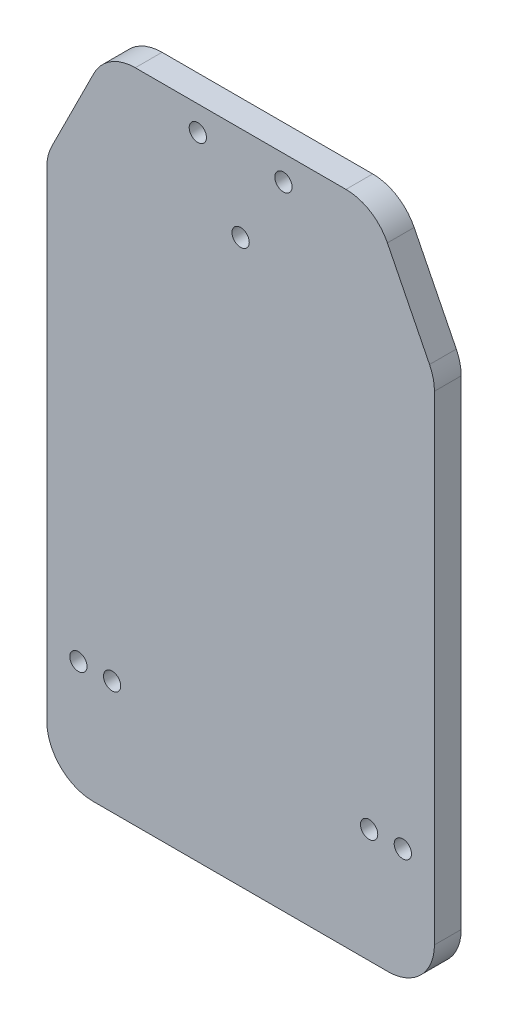
ISO-10303-21;
HEADER;
FILE_DESCRIPTION(('STEP AP214'),'2;1');
FILE_NAME('part.step','',(''),(''),'','','');
FILE_SCHEMA(('AUTOMOTIVE_DESIGN { 1 0 10303 214 1 1 1 1 }'));
ENDSEC;
DATA;
#1=APPLICATION_CONTEXT('core data for automotive mechanical design processes');
#2=APPLICATION_PROTOCOL_DEFINITION('international standard','automotive_design',2000,#1);
#3=PRODUCT_CONTEXT('',#1,'mechanical');
#4=PRODUCT('Part','Part','',(#3));
#5=PRODUCT_RELATED_PRODUCT_CATEGORY('part','',(#4));
#6=PRODUCT_DEFINITION_FORMATION('','',#4);
#7=PRODUCT_DEFINITION_CONTEXT('part definition',#1,'design');
#8=PRODUCT_DEFINITION('design','',#6,#7);
#9=PRODUCT_DEFINITION_SHAPE('','',#8);
#10=(LENGTH_UNIT() NAMED_UNIT(*) SI_UNIT(.MILLI.,.METRE.));
#11=(NAMED_UNIT(*) PLANE_ANGLE_UNIT() SI_UNIT($,.RADIAN.));
#12=(NAMED_UNIT(*) SI_UNIT($,.STERADIAN.) SOLID_ANGLE_UNIT());
#13=UNCERTAINTY_MEASURE_WITH_UNIT(LENGTH_MEASURE(1.E-05),#10,'distance_accuracy_value','');
#14=(GEOMETRIC_REPRESENTATION_CONTEXT(3) GLOBAL_UNCERTAINTY_ASSIGNED_CONTEXT((#13)) GLOBAL_UNIT_ASSIGNED_CONTEXT((#10,
#11,#12)) REPRESENTATION_CONTEXT('',''));
#15=CARTESIAN_POINT('',(0.,0.,0.));
#16=DIRECTION('',(0.,0.,1.));
#17=DIRECTION('',(1.,0.,0.));
#18=AXIS2_PLACEMENT_3D('',#15,#16,#17);
#19=CARTESIAN_POINT('',(55.,144.8,6.35));
#20=DIRECTION('',(0.,-1.,0.));
#21=DIRECTION('',(0.,0.,-1.));
#22=AXIS2_PLACEMENT_3D('',#19,#20,#21);
#23=PLANE('',#22);
#24=DIRECTION('',(-1.,0.,0.));
#25=VECTOR('',#24,1.);
#26=CARTESIAN_POINT('',(55.,144.8,0.));
#27=LINE('',#26,#25);
#28=CARTESIAN_POINT('',(80.,144.8,0.));
#29=VERTEX_POINT('',#28);
#30=CARTESIAN_POINT('',(30.,144.8,0.));
#31=VERTEX_POINT('',#30);
#32=EDGE_CURVE('E104',#29,#31,#27,.T.);
#33=ORIENTED_EDGE('',*,*,#32,.T.);
#34=DIRECTION('',(0.,0.,-1.));
#35=VECTOR('',#34,1.);
#36=CARTESIAN_POINT('',(30.,144.8,6.35));
#37=LINE('',#36,#35);
#38=CARTESIAN_POINT('',(30.,144.8,6.35));
#39=VERTEX_POINT('',#38);
#40=EDGE_CURVE('E11',#39,#31,#37,.T.);
#41=ORIENTED_EDGE('',*,*,#40,.F.);
#42=DIRECTION('',(1.,0.,0.));
#43=VECTOR('',#42,1.);
#44=CARTESIAN_POINT('',(55.,144.8,6.35));
#45=LINE('',#44,#43);
#46=CARTESIAN_POINT('',(80.,144.8,6.35));
#47=VERTEX_POINT('',#46);
#48=EDGE_CURVE('E58',#39,#47,#45,.T.);
#49=ORIENTED_EDGE('',*,*,#48,.T.);
#50=DIRECTION('',(0.,0.,-1.));
#51=VECTOR('',#50,1.);
#52=CARTESIAN_POINT('',(80.,144.8,6.35));
#53=LINE('',#52,#51);
#54=EDGE_CURVE('E43',#47,#29,#53,.T.);
#55=ORIENTED_EDGE('',*,*,#54,.T.);
#56=EDGE_LOOP('',(#33,#41,#49,#55));
#57=FACE_BOUND('',#56,.T.);
#58=ADVANCED_FACE('F39',(#57),#23,.F.);
#59=CARTESIAN_POINT('',(30.,133.8,6.35));
#60=DIRECTION('',(0.,0.,-1.));
#61=DIRECTION('',(-1.,0.,0.));
#62=AXIS2_PLACEMENT_3D('',#59,#60,#61);
#63=CYLINDRICAL_SURFACE('',#62,11.);
#64=CARTESIAN_POINT('',(30.,133.8,0.));
#65=DIRECTION('',(0.,0.,1.));
#66=DIRECTION('',(1.,0.,0.));
#67=AXIS2_PLACEMENT_3D('',#64,#65,#66);
#68=CIRCLE('',#67,11.);
#69=CARTESIAN_POINT('',(20.1613008990009,138.7193495505,0.));
#70=VERTEX_POINT('',#69);
#71=EDGE_CURVE('E98',#31,#70,#68,.T.);
#72=ORIENTED_EDGE('',*,*,#71,.T.);
#73=DIRECTION('',(0.,0.,-1.));
#74=VECTOR('',#73,1.);
#75=CARTESIAN_POINT('',(20.1613008990009,138.7193495505,6.35));
#76=LINE('',#75,#74);
#77=CARTESIAN_POINT('',(20.1613008990009,138.7193495505,6.35));
#78=VERTEX_POINT('',#77);
#79=EDGE_CURVE('E49',#78,#70,#76,.T.);
#80=ORIENTED_EDGE('',*,*,#79,.F.);
#81=CARTESIAN_POINT('',(30.,133.8,6.35));
#82=DIRECTION('',(0.,0.,1.));
#83=DIRECTION('',(1.,0.,0.));
#84=AXIS2_PLACEMENT_3D('',#81,#82,#83);
#85=CIRCLE('',#84,11.);
#86=EDGE_CURVE('E143',#39,#78,#85,.T.);
#87=ORIENTED_EDGE('',*,*,#86,.F.);
#88=ORIENTED_EDGE('',*,*,#40,.T.);
#89=EDGE_LOOP('',(#72,#80,#87,#88));
#90=FACE_BOUND('',#89,.T.);
#91=ADVANCED_FACE('F320',(#90),#63,.T.);
#92=CARTESIAN_POINT('',(20.1613008990009,138.7193495505,6.35));
#93=DIRECTION('',(0.894427190999917,-0.447213595499957,0.));
#94=DIRECTION('',(0.447213595499957,0.894427190999917,0.));
#95=AXIS2_PLACEMENT_3D('',#92,#93,#94);
#96=PLANE('',#95);
#97=DIRECTION('',(-0.447213595499957,-0.894427190999917,0.));
#98=VECTOR('',#97,1.);
#99=CARTESIAN_POINT('',(20.1613008990009,138.7193495505,0.));
#100=LINE('',#99,#98);
#101=CARTESIAN_POINT('',(10.161300899001,118.7193495505,0.));
#102=VERTEX_POINT('',#101);
#103=EDGE_CURVE('E150',#70,#102,#100,.T.);
#104=ORIENTED_EDGE('',*,*,#103,.T.);
#105=DIRECTION('',(0.,0.,-1.));
#106=VECTOR('',#105,1.);
#107=CARTESIAN_POINT('',(10.161300899001,118.7193495505,6.35));
#108=LINE('',#107,#106);
#109=CARTESIAN_POINT('',(10.161300899001,118.7193495505,6.35));
#110=VERTEX_POINT('',#109);
#111=EDGE_CURVE('E147',#110,#102,#108,.T.);
#112=ORIENTED_EDGE('',*,*,#111,.F.);
#113=DIRECTION('',(-0.447213595499957,-0.894427190999917,0.));
#114=VECTOR('',#113,1.);
#115=CARTESIAN_POINT('',(20.1613008990009,138.7193495505,6.35));
#116=LINE('',#115,#114);
#117=EDGE_CURVE('E136',#78,#110,#116,.T.);
#118=ORIENTED_EDGE('',*,*,#117,.F.);
#119=ORIENTED_EDGE('',*,*,#79,.T.);
#120=EDGE_LOOP('',(#104,#112,#118,#119));
#121=FACE_BOUND('',#120,.T.);
#122=ADVANCED_FACE('F148',(#121),#96,.F.);
#123=CARTESIAN_POINT('',(20.,113.8,6.35));
#124=DIRECTION('',(0.,0.,-1.));
#125=DIRECTION('',(-1.,0.,0.));
#126=AXIS2_PLACEMENT_3D('',#123,#124,#125);
#127=CYLINDRICAL_SURFACE('',#126,11.);
#128=CARTESIAN_POINT('',(20.,113.8,0.));
#129=DIRECTION('',(0.,0.,1.));
#130=DIRECTION('',(1.,0.,0.));
#131=AXIS2_PLACEMENT_3D('',#128,#129,#130);
#132=CIRCLE('',#131,11.);
#133=CARTESIAN_POINT('',(9.00000000000001,113.8,0.));
#134=VERTEX_POINT('',#133);
#135=EDGE_CURVE('E188',#102,#134,#132,.T.);
#136=ORIENTED_EDGE('',*,*,#135,.T.);
#137=DIRECTION('',(0.,0.,-1.));
#138=VECTOR('',#137,1.);
#139=CARTESIAN_POINT('',(9.00000000000001,113.8,6.35));
#140=LINE('',#139,#138);
#141=CARTESIAN_POINT('',(9.00000000000001,113.8,6.35));
#142=VERTEX_POINT('',#141);
#143=EDGE_CURVE('E153',#142,#134,#140,.T.);
#144=ORIENTED_EDGE('',*,*,#143,.F.);
#145=CARTESIAN_POINT('',(20.,113.8,6.35));
#146=DIRECTION('',(0.,0.,1.));
#147=DIRECTION('',(1.,0.,0.));
#148=AXIS2_PLACEMENT_3D('',#145,#146,#147);
#149=CIRCLE('',#148,11.);
#150=EDGE_CURVE('E140',#110,#142,#149,.T.);
#151=ORIENTED_EDGE('',*,*,#150,.F.);
#152=ORIENTED_EDGE('',*,*,#111,.T.);
#153=EDGE_LOOP('',(#136,#144,#151,#152));
#154=FACE_BOUND('',#153,.T.);
#155=ADVANCED_FACE('F155',(#154),#127,.T.);
#156=CARTESIAN_POINT('',(9.,113.8,6.35));
#157=DIRECTION('',(1.,0.,0.));
#158=DIRECTION('',(0.,0.,-1.));
#159=AXIS2_PLACEMENT_3D('',#156,#157,#158);
#160=PLANE('',#159);
#161=DIRECTION('',(0.,-1.,0.));
#162=VECTOR('',#161,1.);
#163=CARTESIAN_POINT('',(9.,113.8,0.));
#164=LINE('',#163,#162);
#165=CARTESIAN_POINT('',(9.,0.,0.));
#166=VERTEX_POINT('',#165);
#167=EDGE_CURVE('E186',#134,#166,#164,.T.);
#168=ORIENTED_EDGE('',*,*,#167,.T.);
#169=DIRECTION('',(0.,0.,-1.));
#170=VECTOR('',#169,1.);
#171=CARTESIAN_POINT('',(9.,0.,6.35));
#172=LINE('',#171,#170);
#173=CARTESIAN_POINT('',(9.,0.,6.35));
#174=VERTEX_POINT('',#173);
#175=EDGE_CURVE('E195',#174,#166,#172,.T.);
#176=ORIENTED_EDGE('',*,*,#175,.F.);
#177=DIRECTION('',(0.,-1.,0.));
#178=VECTOR('',#177,1.);
#179=CARTESIAN_POINT('',(9.,113.8,6.35));
#180=LINE('',#179,#178);
#181=EDGE_CURVE('E158',#142,#174,#180,.T.);
#182=ORIENTED_EDGE('',*,*,#181,.F.);
#183=ORIENTED_EDGE('',*,*,#143,.T.);
#184=EDGE_LOOP('',(#168,#176,#182,#183));
#185=FACE_BOUND('',#184,.T.);
#186=ADVANCED_FACE('F215',(#185),#160,.F.);
#187=CARTESIAN_POINT('',(20.,0.,6.35));
#188=DIRECTION('',(0.,0.,-1.));
#189=DIRECTION('',(-1.,0.,0.));
#190=AXIS2_PLACEMENT_3D('',#187,#188,#189);
#191=CYLINDRICAL_SURFACE('',#190,11.);
#192=CARTESIAN_POINT('',(20.,0.,0.));
#193=DIRECTION('',(0.,0.,1.));
#194=DIRECTION('',(1.,0.,0.));
#195=AXIS2_PLACEMENT_3D('',#192,#193,#194);
#196=CIRCLE('',#195,11.);
#197=CARTESIAN_POINT('',(20.,-11.,0.));
#198=VERTEX_POINT('',#197);
#199=EDGE_CURVE('E184',#166,#198,#196,.T.);
#200=ORIENTED_EDGE('',*,*,#199,.T.);
#201=DIRECTION('',(0.,0.,-1.));
#202=VECTOR('',#201,1.);
#203=CARTESIAN_POINT('',(20.,-11.,6.35));
#204=LINE('',#203,#202);
#205=CARTESIAN_POINT('',(20.,-11.,6.35));
#206=VERTEX_POINT('',#205);
#207=EDGE_CURVE('E198',#206,#198,#204,.T.);
#208=ORIENTED_EDGE('',*,*,#207,.F.);
#209=CARTESIAN_POINT('',(20.,0.,6.35));
#210=DIRECTION('',(0.,0.,1.));
#211=DIRECTION('',(1.,0.,0.));
#212=AXIS2_PLACEMENT_3D('',#209,#210,#211);
#213=CIRCLE('',#212,11.);
#214=EDGE_CURVE('E160',#174,#206,#213,.T.);
#215=ORIENTED_EDGE('',*,*,#214,.F.);
#216=ORIENTED_EDGE('',*,*,#175,.T.);
#217=EDGE_LOOP('',(#200,#208,#215,#216));
#218=FACE_BOUND('',#217,.T.);
#219=ADVANCED_FACE('F224',(#218),#191,.T.);
#220=CARTESIAN_POINT('',(20.,-11.,6.35));
#221=DIRECTION('',(0.,1.,0.));
#222=DIRECTION('',(0.,0.,1.));
#223=AXIS2_PLACEMENT_3D('',#220,#221,#222);
#224=PLANE('',#223);
#225=DIRECTION('',(1.,0.,0.));
#226=VECTOR('',#225,1.);
#227=CARTESIAN_POINT('',(20.,-11.,0.));
#228=LINE('',#227,#226);
#229=CARTESIAN_POINT('',(90.,-11.,0.));
#230=VERTEX_POINT('',#229);
#231=EDGE_CURVE('E181',#198,#230,#228,.T.);
#232=ORIENTED_EDGE('',*,*,#231,.T.);
#233=DIRECTION('',(0.,0.,-1.));
#234=VECTOR('',#233,1.);
#235=CARTESIAN_POINT('',(90.,-11.,6.35));
#236=LINE('',#235,#234);
#237=CARTESIAN_POINT('',(90.,-11.,6.35));
#238=VERTEX_POINT('',#237);
#239=EDGE_CURVE('E201',#238,#230,#236,.T.);
#240=ORIENTED_EDGE('',*,*,#239,.F.);
#241=DIRECTION('',(1.,0.,0.));
#242=VECTOR('',#241,1.);
#243=CARTESIAN_POINT('',(20.,-11.,6.35));
#244=LINE('',#243,#242);
#245=EDGE_CURVE('E221',#206,#238,#244,.T.);
#246=ORIENTED_EDGE('',*,*,#245,.F.);
#247=ORIENTED_EDGE('',*,*,#207,.T.);
#248=EDGE_LOOP('',(#232,#240,#246,#247));
#249=FACE_BOUND('',#248,.T.);
#250=ADVANCED_FACE('F227',(#249),#224,.F.);
#251=CARTESIAN_POINT('',(90.,0.,6.35));
#252=DIRECTION('',(0.,0.,-1.));
#253=DIRECTION('',(-1.,0.,0.));
#254=AXIS2_PLACEMENT_3D('',#251,#252,#253);
#255=CYLINDRICAL_SURFACE('',#254,11.);
#256=CARTESIAN_POINT('',(90.,0.,0.));
#257=DIRECTION('',(0.,0.,-1.));
#258=DIRECTION('',(-1.,0.,0.));
#259=AXIS2_PLACEMENT_3D('',#256,#257,#258);
#260=CIRCLE('',#259,11.);
#261=CARTESIAN_POINT('',(101.,0.,0.));
#262=VERTEX_POINT('',#261);
#263=EDGE_CURVE('E178',#262,#230,#260,.T.);
#264=ORIENTED_EDGE('',*,*,#263,.F.);
#265=DIRECTION('',(0.,0.,-1.));
#266=VECTOR('',#265,1.);
#267=CARTESIAN_POINT('',(101.,0.,6.35));
#268=LINE('',#267,#266);
#269=CARTESIAN_POINT('',(101.,0.,6.35));
#270=VERTEX_POINT('',#269);
#271=EDGE_CURVE('E203',#270,#262,#268,.T.);
#272=ORIENTED_EDGE('',*,*,#271,.F.);
#273=CARTESIAN_POINT('',(90.,0.,6.35));
#274=DIRECTION('',(0.,0.,-1.));
#275=DIRECTION('',(-1.,0.,0.));
#276=AXIS2_PLACEMENT_3D('',#273,#274,#275);
#277=CIRCLE('',#276,11.);
#278=EDGE_CURVE('E229',#270,#238,#277,.T.);
#279=ORIENTED_EDGE('',*,*,#278,.T.);
#280=ORIENTED_EDGE('',*,*,#239,.T.);
#281=EDGE_LOOP('',(#264,#272,#279,#280));
#282=FACE_BOUND('',#281,.T.);
#283=ADVANCED_FACE('F336',(#282),#255,.T.);
#284=CARTESIAN_POINT('',(101.,113.8,6.35));
#285=DIRECTION('',(1.,0.,0.));
#286=DIRECTION('',(0.,0.,-1.));
#287=AXIS2_PLACEMENT_3D('',#284,#285,#286);
#288=PLANE('',#287);
#289=DIRECTION('',(0.,-1.,0.));
#290=VECTOR('',#289,1.);
#291=CARTESIAN_POINT('',(101.,113.8,0.));
#292=LINE('',#291,#290);
#293=CARTESIAN_POINT('',(101.,113.8,0.));
#294=VERTEX_POINT('',#293);
#295=EDGE_CURVE('E175',#294,#262,#292,.T.);
#296=ORIENTED_EDGE('',*,*,#295,.F.);
#297=DIRECTION('',(0.,0.,-1.));
#298=VECTOR('',#297,1.);
#299=CARTESIAN_POINT('',(101.,113.8,6.35));
#300=LINE('',#299,#298);
#301=CARTESIAN_POINT('',(101.,113.8,6.35));
#302=VERTEX_POINT('',#301);
#303=EDGE_CURVE('E205',#302,#294,#300,.T.);
#304=ORIENTED_EDGE('',*,*,#303,.F.);
#305=DIRECTION('',(0.,-1.,0.));
#306=VECTOR('',#305,1.);
#307=CARTESIAN_POINT('',(101.,113.8,6.35));
#308=LINE('',#307,#306);
#309=EDGE_CURVE('E231',#302,#270,#308,.T.);
#310=ORIENTED_EDGE('',*,*,#309,.T.);
#311=ORIENTED_EDGE('',*,*,#271,.T.);
#312=EDGE_LOOP('',(#296,#304,#310,#311));
#313=FACE_BOUND('',#312,.T.);
#314=ADVANCED_FACE('F339',(#313),#288,.T.);
#315=CARTESIAN_POINT('',(90.,113.8,6.35));
#316=DIRECTION('',(0.,0.,-1.));
#317=DIRECTION('',(-1.,0.,0.));
#318=AXIS2_PLACEMENT_3D('',#315,#316,#317);
#319=CYLINDRICAL_SURFACE('',#318,11.);
#320=CARTESIAN_POINT('',(90.,113.8,0.));
#321=DIRECTION('',(0.,0.,-1.));
#322=DIRECTION('',(-1.,0.,0.));
#323=AXIS2_PLACEMENT_3D('',#320,#321,#322);
#324=CIRCLE('',#323,11.);
#325=CARTESIAN_POINT('',(99.8386991009991,118.7193495505,0.));
#326=VERTEX_POINT('',#325);
#327=EDGE_CURVE('E172',#326,#294,#324,.T.);
#328=ORIENTED_EDGE('',*,*,#327,.F.);
#329=DIRECTION('',(0.,0.,-1.));
#330=VECTOR('',#329,1.);
#331=CARTESIAN_POINT('',(99.8386991009991,118.7193495505,6.35));
#332=LINE('',#331,#330);
#333=CARTESIAN_POINT('',(99.8386991009991,118.7193495505,6.35));
#334=VERTEX_POINT('',#333);
#335=EDGE_CURVE('E207',#334,#326,#332,.T.);
#336=ORIENTED_EDGE('',*,*,#335,.F.);
#337=CARTESIAN_POINT('',(90.,113.8,6.35));
#338=DIRECTION('',(0.,0.,-1.));
#339=DIRECTION('',(-1.,0.,0.));
#340=AXIS2_PLACEMENT_3D('',#337,#338,#339);
#341=CIRCLE('',#340,11.);
#342=EDGE_CURVE('E236',#334,#302,#341,.T.);
#343=ORIENTED_EDGE('',*,*,#342,.T.);
#344=ORIENTED_EDGE('',*,*,#303,.T.);
#345=EDGE_LOOP('',(#328,#336,#343,#344));
#346=FACE_BOUND('',#345,.T.);
#347=ADVANCED_FACE('F343',(#346),#319,.T.);
#348=CARTESIAN_POINT('',(89.8386991009991,138.7193495505,6.35));
#349=DIRECTION('',(0.894427190999915,0.447213595499959,0.));
#350=DIRECTION('',(-0.447213595499959,0.894427190999916,0.));
#351=AXIS2_PLACEMENT_3D('',#348,#349,#350);
#352=PLANE('',#351);
#353=DIRECTION('',(0.447213595499959,-0.894427190999916,0.));
#354=VECTOR('',#353,1.);
#355=CARTESIAN_POINT('',(89.8386991009991,138.7193495505,0.));
#356=LINE('',#355,#354);
#357=CARTESIAN_POINT('',(89.8386991009991,138.7193495505,0.));
#358=VERTEX_POINT('',#357);
#359=EDGE_CURVE('E168',#358,#326,#356,.T.);
#360=ORIENTED_EDGE('',*,*,#359,.F.);
#361=DIRECTION('',(0.,0.,-1.));
#362=VECTOR('',#361,1.);
#363=CARTESIAN_POINT('',(89.8386991009991,138.7193495505,6.35));
#364=LINE('',#363,#362);
#365=CARTESIAN_POINT('',(89.8386991009991,138.7193495505,6.35));
#366=VERTEX_POINT('',#365);
#367=EDGE_CURVE('E208',#366,#358,#364,.T.);
#368=ORIENTED_EDGE('',*,*,#367,.F.);
#369=DIRECTION('',(0.447213595499959,-0.894427190999916,0.));
#370=VECTOR('',#369,1.);
#371=CARTESIAN_POINT('',(89.8386991009991,138.7193495505,6.35));
#372=LINE('',#371,#370);
#373=EDGE_CURVE('E239',#366,#334,#372,.T.);
#374=ORIENTED_EDGE('',*,*,#373,.T.);
#375=ORIENTED_EDGE('',*,*,#335,.T.);
#376=EDGE_LOOP('',(#360,#368,#374,#375));
#377=FACE_BOUND('',#376,.T.);
#378=ADVANCED_FACE('F346',(#377),#352,.T.);
#379=CARTESIAN_POINT('',(80.,133.8,6.35));
#380=DIRECTION('',(0.,0.,-1.));
#381=DIRECTION('',(-1.,0.,0.));
#382=AXIS2_PLACEMENT_3D('',#379,#380,#381);
#383=CYLINDRICAL_SURFACE('',#382,11.);
#384=CARTESIAN_POINT('',(80.,133.8,0.));
#385=DIRECTION('',(0.,0.,-1.));
#386=DIRECTION('',(-1.,0.,0.));
#387=AXIS2_PLACEMENT_3D('',#384,#385,#386);
#388=CIRCLE('',#387,11.);
#389=EDGE_CURVE('E165',#29,#358,#388,.T.);
#390=ORIENTED_EDGE('',*,*,#389,.F.);
#391=ORIENTED_EDGE('',*,*,#54,.F.);
#392=CARTESIAN_POINT('',(80.,133.8,6.35));
#393=DIRECTION('',(0.,0.,-1.));
#394=DIRECTION('',(-1.,0.,0.));
#395=AXIS2_PLACEMENT_3D('',#392,#393,#394);
#396=CIRCLE('',#395,11.);
#397=EDGE_CURVE('E242',#47,#366,#396,.T.);
#398=ORIENTED_EDGE('',*,*,#397,.T.);
#399=ORIENTED_EDGE('',*,*,#367,.T.);
#400=EDGE_LOOP('',(#390,#391,#398,#399));
#401=FACE_BOUND('',#400,.T.);
#402=ADVANCED_FACE('F41',(#401),#383,.T.);
#403=CARTESIAN_POINT('',(80.,133.8,6.35));
#404=DIRECTION('',(0.,0.,-1.));
#405=DIRECTION('',(-1.,0.,0.));
#406=AXIS2_PLACEMENT_3D('',#403,#404,#405);
#407=PLANE('',#406);
#408=CARTESIAN_POINT('',(16.5,16.,6.35));
#409=DIRECTION('',(0.,0.,1.));
#410=DIRECTION('',(1.,0.,0.));
#411=AXIS2_PLACEMENT_3D('',#408,#409,#410);
#412=CIRCLE('',#411,2.05);
#413=CARTESIAN_POINT('',(18.55,16.,6.35));
#414=VERTEX_POINT('',#413);
#415=EDGE_CURVE('E256',#414,#414,#412,.T.);
#416=ORIENTED_EDGE('',*,*,#415,.F.);
#417=EDGE_LOOP('',(#416));
#418=FACE_BOUND('',#417,.T.);
#419=CARTESIAN_POINT('',(65.16,138.898469816456,6.35));
#420=DIRECTION('',(0.,0.,1.));
#421=DIRECTION('',(1.,0.,0.));
#422=AXIS2_PLACEMENT_3D('',#419,#420,#421);
#423=CIRCLE('',#422,2.04999999999999);
#424=CARTESIAN_POINT('',(67.21,138.898469816456,6.35));
#425=VERTEX_POINT('',#424);
#426=EDGE_CURVE('E271',#425,#425,#423,.T.);
#427=ORIENTED_EDGE('',*,*,#426,.F.);
#428=EDGE_LOOP('',(#427));
#429=FACE_BOUND('',#428,.T.);
#430=CARTESIAN_POINT('',(55.,122.428157316456,6.35));
#431=DIRECTION('',(0.,0.,1.));
#432=DIRECTION('',(1.,0.,0.));
#433=AXIS2_PLACEMENT_3D('',#430,#431,#432);
#434=CIRCLE('',#433,2.04999999999999);
#435=CARTESIAN_POINT('',(57.05,122.428157316456,6.35));
#436=VERTEX_POINT('',#435);
#437=EDGE_CURVE('E266',#436,#436,#434,.T.);
#438=ORIENTED_EDGE('',*,*,#437,.F.);
#439=EDGE_LOOP('',(#438));
#440=FACE_BOUND('',#439,.T.);
#441=CARTESIAN_POINT('',(24.5,16.,6.35));
#442=DIRECTION('',(0.,0.,1.));
#443=DIRECTION('',(1.,0.,0.));
#444=AXIS2_PLACEMENT_3D('',#441,#442,#443);
#445=CIRCLE('',#444,2.05);
#446=CARTESIAN_POINT('',(26.55,16.,6.35));
#447=VERTEX_POINT('',#446);
#448=EDGE_CURVE('E253',#447,#447,#445,.T.);
#449=ORIENTED_EDGE('',*,*,#448,.F.);
#450=EDGE_LOOP('',(#449));
#451=FACE_BOUND('',#450,.T.);
#452=CARTESIAN_POINT('',(85.5,16.,6.35));
#453=DIRECTION('',(0.,0.,1.));
#454=DIRECTION('',(1.,0.,0.));
#455=AXIS2_PLACEMENT_3D('',#452,#453,#454);
#456=CIRCLE('',#455,2.04999999999999);
#457=CARTESIAN_POINT('',(87.55,16.,6.35));
#458=VERTEX_POINT('',#457);
#459=EDGE_CURVE('E245',#458,#458,#456,.T.);
#460=ORIENTED_EDGE('',*,*,#459,.F.);
#461=EDGE_LOOP('',(#460));
#462=FACE_BOUND('',#461,.T.);
#463=CARTESIAN_POINT('',(93.5,16.,6.35));
#464=DIRECTION('',(0.,0.,1.));
#465=DIRECTION('',(1.,0.,0.));
#466=AXIS2_PLACEMENT_3D('',#463,#464,#465);
#467=CIRCLE('',#466,2.04999999999999);
#468=CARTESIAN_POINT('',(95.55,16.,6.35));
#469=VERTEX_POINT('',#468);
#470=EDGE_CURVE('E252',#469,#469,#467,.T.);
#471=ORIENTED_EDGE('',*,*,#470,.F.);
#472=EDGE_LOOP('',(#471));
#473=FACE_BOUND('',#472,.T.);
#474=CARTESIAN_POINT('',(44.84,138.898469816456,6.35));
#475=DIRECTION('',(0.,0.,1.));
#476=DIRECTION('',(1.,0.,0.));
#477=AXIS2_PLACEMENT_3D('',#474,#475,#476);
#478=CIRCLE('',#477,2.04999999999999);
#479=CARTESIAN_POINT('',(46.89,138.898469816456,6.35));
#480=VERTEX_POINT('',#479);
#481=EDGE_CURVE('E259',#480,#480,#478,.T.);
#482=ORIENTED_EDGE('',*,*,#481,.F.);
#483=EDGE_LOOP('',(#482));
#484=FACE_BOUND('',#483,.T.);
#485=ORIENTED_EDGE('',*,*,#48,.F.);
#486=ORIENTED_EDGE('',*,*,#86,.T.);
#487=ORIENTED_EDGE('',*,*,#117,.T.);
#488=ORIENTED_EDGE('',*,*,#150,.T.);
#489=ORIENTED_EDGE('',*,*,#181,.T.);
#490=ORIENTED_EDGE('',*,*,#214,.T.);
#491=ORIENTED_EDGE('',*,*,#245,.T.);
#492=ORIENTED_EDGE('',*,*,#278,.F.);
#493=ORIENTED_EDGE('',*,*,#309,.F.);
#494=ORIENTED_EDGE('',*,*,#342,.F.);
#495=ORIENTED_EDGE('',*,*,#373,.F.);
#496=ORIENTED_EDGE('',*,*,#397,.F.);
#497=EDGE_LOOP('',(#485,#486,#487,#488,#489,#490,#491,#492,#493,#494,#495,#496));
#498=FACE_BOUND('',#497,.T.);
#499=ADVANCED_FACE('F138',(#418,#429,#440,#451,#462,#473,#484,#498),#407,.F.);
#500=CARTESIAN_POINT('',(80.,133.8,0.));
#501=DIRECTION('',(0.,0.,-1.));
#502=DIRECTION('',(-1.,0.,0.));
#503=AXIS2_PLACEMENT_3D('',#500,#501,#502);
#504=PLANE('',#503);
#505=CARTESIAN_POINT('',(16.5,16.,0.));
#506=DIRECTION('',(0.,0.,-1.));
#507=DIRECTION('',(-1.,0.,0.));
#508=AXIS2_PLACEMENT_3D('',#505,#506,#507);
#509=CIRCLE('',#508,2.05);
#510=CARTESIAN_POINT('',(14.45,16.,0.));
#511=VERTEX_POINT('',#510);
#512=EDGE_CURVE('E169',#511,#511,#509,.F.);
#513=ORIENTED_EDGE('',*,*,#512,.T.);
#514=EDGE_LOOP('',(#513));
#515=FACE_BOUND('',#514,.T.);
#516=CARTESIAN_POINT('',(65.16,138.898469816456,0.));
#517=DIRECTION('',(0.,0.,-1.));
#518=DIRECTION('',(-1.,0.,0.));
#519=AXIS2_PLACEMENT_3D('',#516,#517,#518);
#520=CIRCLE('',#519,2.04999999999999);
#521=CARTESIAN_POINT('',(63.11,138.898469816456,0.));
#522=VERTEX_POINT('',#521);
#523=EDGE_CURVE('E275',#522,#522,#520,.F.);
#524=ORIENTED_EDGE('',*,*,#523,.T.);
#525=EDGE_LOOP('',(#524));
#526=FACE_BOUND('',#525,.T.);
#527=CARTESIAN_POINT('',(55.,122.428157316456,0.));
#528=DIRECTION('',(0.,0.,-1.));
#529=DIRECTION('',(-1.,0.,0.));
#530=AXIS2_PLACEMENT_3D('',#527,#528,#529);
#531=CIRCLE('',#530,2.04999999999999);
#532=CARTESIAN_POINT('',(52.95,122.428157316456,0.));
#533=VERTEX_POINT('',#532);
#534=EDGE_CURVE('E274',#533,#533,#531,.F.);
#535=ORIENTED_EDGE('',*,*,#534,.T.);
#536=EDGE_LOOP('',(#535));
#537=FACE_BOUND('',#536,.T.);
#538=CARTESIAN_POINT('',(24.5,16.,0.));
#539=DIRECTION('',(0.,0.,-1.));
#540=DIRECTION('',(-1.,0.,0.));
#541=AXIS2_PLACEMENT_3D('',#538,#539,#540);
#542=CIRCLE('',#541,2.05);
#543=CARTESIAN_POINT('',(22.45,16.,0.));
#544=VERTEX_POINT('',#543);
#545=EDGE_CURVE('E248',#544,#544,#542,.F.);
#546=ORIENTED_EDGE('',*,*,#545,.T.);
#547=EDGE_LOOP('',(#546));
#548=FACE_BOUND('',#547,.T.);
#549=CARTESIAN_POINT('',(85.5,16.,0.));
#550=DIRECTION('',(0.,0.,-1.));
#551=DIRECTION('',(-1.,0.,0.));
#552=AXIS2_PLACEMENT_3D('',#549,#550,#551);
#553=CIRCLE('',#552,2.04999999999999);
#554=CARTESIAN_POINT('',(83.45,16.,0.));
#555=VERTEX_POINT('',#554);
#556=EDGE_CURVE('E249',#555,#555,#553,.F.);
#557=ORIENTED_EDGE('',*,*,#556,.T.);
#558=EDGE_LOOP('',(#557));
#559=FACE_BOUND('',#558,.T.);
#560=CARTESIAN_POINT('',(93.5,16.,0.));
#561=DIRECTION('',(0.,0.,-1.));
#562=DIRECTION('',(-1.,0.,0.));
#563=AXIS2_PLACEMENT_3D('',#560,#561,#562);
#564=CIRCLE('',#563,2.04999999999999);
#565=CARTESIAN_POINT('',(91.45,16.,0.));
#566=VERTEX_POINT('',#565);
#567=EDGE_CURVE('E262',#566,#566,#564,.F.);
#568=ORIENTED_EDGE('',*,*,#567,.T.);
#569=EDGE_LOOP('',(#568));
#570=FACE_BOUND('',#569,.T.);
#571=CARTESIAN_POINT('',(44.84,138.898469816456,0.));
#572=DIRECTION('',(0.,0.,-1.));
#573=DIRECTION('',(-1.,0.,0.));
#574=AXIS2_PLACEMENT_3D('',#571,#572,#573);
#575=CIRCLE('',#574,2.04999999999999);
#576=CARTESIAN_POINT('',(42.79,138.898469816456,0.));
#577=VERTEX_POINT('',#576);
#578=EDGE_CURVE('E263',#577,#577,#575,.F.);
#579=ORIENTED_EDGE('',*,*,#578,.T.);
#580=EDGE_LOOP('',(#579));
#581=FACE_BOUND('',#580,.T.);
#582=ORIENTED_EDGE('',*,*,#32,.F.);
#583=ORIENTED_EDGE('',*,*,#389,.T.);
#584=ORIENTED_EDGE('',*,*,#359,.T.);
#585=ORIENTED_EDGE('',*,*,#327,.T.);
#586=ORIENTED_EDGE('',*,*,#295,.T.);
#587=ORIENTED_EDGE('',*,*,#263,.T.);
#588=ORIENTED_EDGE('',*,*,#231,.F.);
#589=ORIENTED_EDGE('',*,*,#199,.F.);
#590=ORIENTED_EDGE('',*,*,#167,.F.);
#591=ORIENTED_EDGE('',*,*,#135,.F.);
#592=ORIENTED_EDGE('',*,*,#103,.F.);
#593=ORIENTED_EDGE('',*,*,#71,.F.);
#594=EDGE_LOOP('',(#582,#583,#584,#585,#586,#587,#588,#589,#590,#591,#592,#593));
#595=FACE_BOUND('',#594,.T.);
#596=ADVANCED_FACE('F211',(#515,#526,#537,#548,#559,#570,#581,#595),#504,.T.);
#597=CARTESIAN_POINT('',(44.84,138.898469816456,-5.79827560572969));
#598=DIRECTION('',(0.,0.,1.));
#599=DIRECTION('',(1.,0.,0.));
#600=AXIS2_PLACEMENT_3D('',#597,#598,#599);
#601=CYLINDRICAL_SURFACE('',#600,2.04999999999999);
#602=ORIENTED_EDGE('',*,*,#481,.T.);
#603=EDGE_LOOP('',(#602));
#604=FACE_BOUND('',#603,.T.);
#605=ORIENTED_EDGE('',*,*,#578,.F.);
#606=EDGE_LOOP('',(#605));
#607=FACE_BOUND('',#606,.T.);
#608=ADVANCED_FACE('F305',(#604,#607),#601,.F.);
#609=CARTESIAN_POINT('',(93.5,16.,-5.79827560572969));
#610=DIRECTION('',(0.,0.,1.));
#611=DIRECTION('',(1.,0.,0.));
#612=AXIS2_PLACEMENT_3D('',#609,#610,#611);
#613=CYLINDRICAL_SURFACE('',#612,2.04999999999999);
#614=ORIENTED_EDGE('',*,*,#470,.T.);
#615=EDGE_LOOP('',(#614));
#616=FACE_BOUND('',#615,.T.);
#617=ORIENTED_EDGE('',*,*,#567,.F.);
#618=EDGE_LOOP('',(#617));
#619=FACE_BOUND('',#618,.T.);
#620=ADVANCED_FACE('F308',(#616,#619),#613,.F.);
#621=CARTESIAN_POINT('',(85.5,16.,-5.79827560572969));
#622=DIRECTION('',(0.,0.,1.));
#623=DIRECTION('',(1.,0.,0.));
#624=AXIS2_PLACEMENT_3D('',#621,#622,#623);
#625=CYLINDRICAL_SURFACE('',#624,2.04999999999999);
#626=ORIENTED_EDGE('',*,*,#459,.T.);
#627=EDGE_LOOP('',(#626));
#628=FACE_BOUND('',#627,.T.);
#629=ORIENTED_EDGE('',*,*,#556,.F.);
#630=EDGE_LOOP('',(#629));
#631=FACE_BOUND('',#630,.T.);
#632=ADVANCED_FACE('F386',(#628,#631),#625,.F.);
#633=CARTESIAN_POINT('',(24.5,16.,-5.79827560572969));
#634=DIRECTION('',(0.,0.,1.));
#635=DIRECTION('',(1.,0.,0.));
#636=AXIS2_PLACEMENT_3D('',#633,#634,#635);
#637=CYLINDRICAL_SURFACE('',#636,2.05);
#638=ORIENTED_EDGE('',*,*,#448,.T.);
#639=EDGE_LOOP('',(#638));
#640=FACE_BOUND('',#639,.T.);
#641=ORIENTED_EDGE('',*,*,#545,.F.);
#642=EDGE_LOOP('',(#641));
#643=FACE_BOUND('',#642,.T.);
#644=ADVANCED_FACE('F396',(#640,#643),#637,.F.);
#645=CARTESIAN_POINT('',(55.,122.428157316456,-5.79827560572969));
#646=DIRECTION('',(0.,0.,1.));
#647=DIRECTION('',(1.,0.,0.));
#648=AXIS2_PLACEMENT_3D('',#645,#646,#647);
#649=CYLINDRICAL_SURFACE('',#648,2.04999999999999);
#650=ORIENTED_EDGE('',*,*,#437,.T.);
#651=EDGE_LOOP('',(#650));
#652=FACE_BOUND('',#651,.T.);
#653=ORIENTED_EDGE('',*,*,#534,.F.);
#654=EDGE_LOOP('',(#653));
#655=FACE_BOUND('',#654,.T.);
#656=ADVANCED_FACE('F406',(#652,#655),#649,.F.);
#657=CARTESIAN_POINT('',(65.16,138.898469816456,-5.79827560572969));
#658=DIRECTION('',(0.,0.,1.));
#659=DIRECTION('',(1.,0.,0.));
#660=AXIS2_PLACEMENT_3D('',#657,#658,#659);
#661=CYLINDRICAL_SURFACE('',#660,2.04999999999999);
#662=ORIENTED_EDGE('',*,*,#426,.T.);
#663=EDGE_LOOP('',(#662));
#664=FACE_BOUND('',#663,.T.);
#665=ORIENTED_EDGE('',*,*,#523,.F.);
#666=EDGE_LOOP('',(#665));
#667=FACE_BOUND('',#666,.T.);
#668=ADVANCED_FACE('F416',(#664,#667),#661,.F.);
#669=CARTESIAN_POINT('',(16.5,16.,-5.79827560572969));
#670=DIRECTION('',(0.,0.,1.));
#671=DIRECTION('',(1.,0.,0.));
#672=AXIS2_PLACEMENT_3D('',#669,#670,#671);
#673=CYLINDRICAL_SURFACE('',#672,2.05);
#674=ORIENTED_EDGE('',*,*,#415,.T.);
#675=EDGE_LOOP('',(#674));
#676=FACE_BOUND('',#675,.T.);
#677=ORIENTED_EDGE('',*,*,#512,.F.);
#678=EDGE_LOOP('',(#677));
#679=FACE_BOUND('',#678,.T.);
#680=ADVANCED_FACE('F287',(#676,#679),#673,.F.);
#681=CLOSED_SHELL('',(#58,#91,#122,#155,#186,#219,#250,#283,#314,#347,#378,#402,#499,#596,#608,
#620,#632,#644,#656,#668,#680));
#682=MANIFOLD_SOLID_BREP('B2',#681);
#683=ADVANCED_BREP_SHAPE_REPRESENTATION('',(#18,#682),#14);
#684=SHAPE_DEFINITION_REPRESENTATION(#9,#683);
ENDSEC;
END-ISO-10303-21;
